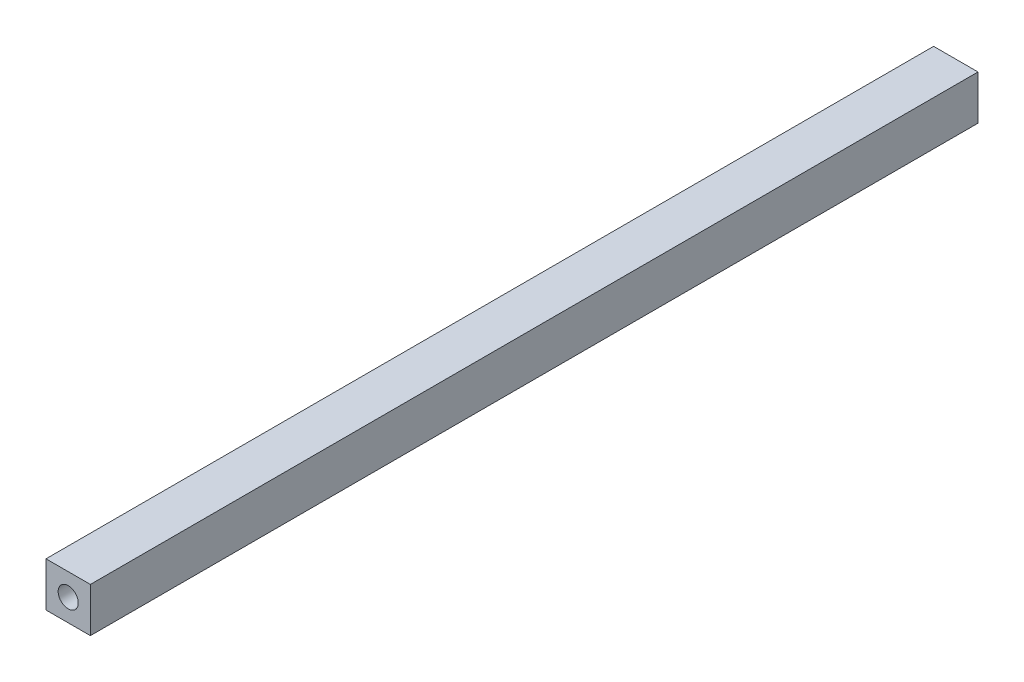
ISO-10303-21;
HEADER;
FILE_DESCRIPTION(('STEP AP214'),'2;1');
FILE_NAME('part.step','',(''),(''),'','','');
FILE_SCHEMA(('AUTOMOTIVE_DESIGN { 1 0 10303 214 1 1 1 1 }'));
ENDSEC;
DATA;
#1=APPLICATION_CONTEXT('core data for automotive mechanical design processes');
#2=APPLICATION_PROTOCOL_DEFINITION('international standard','automotive_design',2000,#1);
#3=PRODUCT_CONTEXT('',#1,'mechanical');
#4=PRODUCT('Part','Part','',(#3));
#5=PRODUCT_RELATED_PRODUCT_CATEGORY('part','',(#4));
#6=PRODUCT_DEFINITION_FORMATION('','',#4);
#7=PRODUCT_DEFINITION_CONTEXT('part definition',#1,'design');
#8=PRODUCT_DEFINITION('design','',#6,#7);
#9=PRODUCT_DEFINITION_SHAPE('','',#8);
#10=(LENGTH_UNIT() NAMED_UNIT(*) SI_UNIT(.MILLI.,.METRE.));
#11=(NAMED_UNIT(*) PLANE_ANGLE_UNIT() SI_UNIT($,.RADIAN.));
#12=(NAMED_UNIT(*) SI_UNIT($,.STERADIAN.) SOLID_ANGLE_UNIT());
#13=UNCERTAINTY_MEASURE_WITH_UNIT(LENGTH_MEASURE(1.E-05),#10,'distance_accuracy_value','');
#14=(GEOMETRIC_REPRESENTATION_CONTEXT(3) GLOBAL_UNCERTAINTY_ASSIGNED_CONTEXT((#13)) GLOBAL_UNIT_ASSIGNED_CONTEXT((#10,
#11,#12)) REPRESENTATION_CONTEXT('',''));
#15=CARTESIAN_POINT('',(0.,0.,0.));
#16=DIRECTION('',(0.,0.,1.));
#17=DIRECTION('',(1.,0.,0.));
#18=AXIS2_PLACEMENT_3D('',#15,#16,#17);
#19=CARTESIAN_POINT('',(7.5,7.5,150.));
#20=DIRECTION('',(-1.,0.,0.));
#21=DIRECTION('',(0.,-1.,0.));
#22=AXIS2_PLACEMENT_3D('',#19,#20,#21);
#23=PLANE('',#22);
#24=DIRECTION('',(0.,1.,0.));
#25=VECTOR('',#24,1.);
#26=CARTESIAN_POINT('',(7.5,7.5,-150.));
#27=LINE('',#26,#25);
#28=CARTESIAN_POINT('',(7.5,-7.5,-150.));
#29=VERTEX_POINT('',#28);
#30=CARTESIAN_POINT('',(7.5,7.5,-150.));
#31=VERTEX_POINT('',#30);
#32=EDGE_CURVE('E115',#29,#31,#27,.T.);
#33=ORIENTED_EDGE('',*,*,#32,.T.);
#34=DIRECTION('',(0.,0.,-1.));
#35=VECTOR('',#34,1.);
#36=CARTESIAN_POINT('',(7.5,7.5,150.));
#37=LINE('',#36,#35);
#38=CARTESIAN_POINT('',(7.5,7.5,150.));
#39=VERTEX_POINT('',#38);
#40=EDGE_CURVE('E11',#39,#31,#37,.T.);
#41=ORIENTED_EDGE('',*,*,#40,.F.);
#42=DIRECTION('',(0.,1.,0.));
#43=VECTOR('',#42,1.);
#44=CARTESIAN_POINT('',(7.5,7.5,150.));
#45=LINE('',#44,#43);
#46=CARTESIAN_POINT('',(7.5,-7.5,150.));
#47=VERTEX_POINT('',#46);
#48=EDGE_CURVE('E116',#47,#39,#45,.T.);
#49=ORIENTED_EDGE('',*,*,#48,.F.);
#50=DIRECTION('',(0.,0.,-1.));
#51=VECTOR('',#50,1.);
#52=CARTESIAN_POINT('',(7.5,-7.5,150.));
#53=LINE('',#52,#51);
#54=EDGE_CURVE('E122',#47,#29,#53,.T.);
#55=ORIENTED_EDGE('',*,*,#54,.T.);
#56=EDGE_LOOP('',(#33,#41,#49,#55));
#57=FACE_BOUND('',#56,.T.);
#58=ADVANCED_FACE('F40',(#57),#23,.F.);
#59=CARTESIAN_POINT('',(-7.5,7.5,150.));
#60=DIRECTION('',(0.,-1.,0.));
#61=DIRECTION('',(0.,0.,-1.));
#62=AXIS2_PLACEMENT_3D('',#59,#60,#61);
#63=PLANE('',#62);
#64=DIRECTION('',(-1.,0.,0.));
#65=VECTOR('',#64,1.);
#66=CARTESIAN_POINT('',(-7.5,7.5,-150.));
#67=LINE('',#66,#65);
#68=CARTESIAN_POINT('',(-7.5,7.5,-150.));
#69=VERTEX_POINT('',#68);
#70=EDGE_CURVE('E125',#31,#69,#67,.T.);
#71=ORIENTED_EDGE('',*,*,#70,.T.);
#72=DIRECTION('',(0.,0.,-1.));
#73=VECTOR('',#72,1.);
#74=CARTESIAN_POINT('',(-7.5,7.5,150.));
#75=LINE('',#74,#73);
#76=CARTESIAN_POINT('',(-7.5,7.5,150.));
#77=VERTEX_POINT('',#76);
#78=EDGE_CURVE('E48',#77,#69,#75,.T.);
#79=ORIENTED_EDGE('',*,*,#78,.F.);
#80=DIRECTION('',(-1.,0.,0.));
#81=VECTOR('',#80,1.);
#82=CARTESIAN_POINT('',(-7.5,7.5,150.));
#83=LINE('',#82,#81);
#84=EDGE_CURVE('E87',#39,#77,#83,.T.);
#85=ORIENTED_EDGE('',*,*,#84,.F.);
#86=ORIENTED_EDGE('',*,*,#40,.T.);
#87=EDGE_LOOP('',(#71,#79,#85,#86));
#88=FACE_BOUND('',#87,.T.);
#89=ADVANCED_FACE('F149',(#88),#63,.F.);
#90=CARTESIAN_POINT('',(-7.5,7.5,150.));
#91=DIRECTION('',(1.,0.,0.));
#92=DIRECTION('',(0.,1.,0.));
#93=AXIS2_PLACEMENT_3D('',#90,#91,#92);
#94=PLANE('',#93);
#95=DIRECTION('',(0.,-1.,0.));
#96=VECTOR('',#95,1.);
#97=CARTESIAN_POINT('',(-7.5,7.5,-150.));
#98=LINE('',#97,#96);
#99=CARTESIAN_POINT('',(-7.5,-7.5,-150.));
#100=VERTEX_POINT('',#99);
#101=EDGE_CURVE('E74',#69,#100,#98,.T.);
#102=ORIENTED_EDGE('',*,*,#101,.T.);
#103=DIRECTION('',(0.,0.,-1.));
#104=VECTOR('',#103,1.);
#105=CARTESIAN_POINT('',(-7.5,-7.5,150.));
#106=LINE('',#105,#104);
#107=CARTESIAN_POINT('',(-7.5,-7.5,150.));
#108=VERTEX_POINT('',#107);
#109=EDGE_CURVE('E130',#108,#100,#106,.T.);
#110=ORIENTED_EDGE('',*,*,#109,.F.);
#111=DIRECTION('',(0.,-1.,0.));
#112=VECTOR('',#111,1.);
#113=CARTESIAN_POINT('',(-7.5,7.5,150.));
#114=LINE('',#113,#112);
#115=EDGE_CURVE('E119',#77,#108,#114,.T.);
#116=ORIENTED_EDGE('',*,*,#115,.F.);
#117=ORIENTED_EDGE('',*,*,#78,.T.);
#118=EDGE_LOOP('',(#102,#110,#116,#117));
#119=FACE_BOUND('',#118,.T.);
#120=ADVANCED_FACE('F132',(#119),#94,.F.);
#121=CARTESIAN_POINT('',(-7.5,-7.5,150.));
#122=DIRECTION('',(0.,1.,0.));
#123=DIRECTION('',(0.,0.,1.));
#124=AXIS2_PLACEMENT_3D('',#121,#122,#123);
#125=PLANE('',#124);
#126=DIRECTION('',(1.,0.,0.));
#127=VECTOR('',#126,1.);
#128=CARTESIAN_POINT('',(-7.5,-7.5,-150.));
#129=LINE('',#128,#127);
#130=EDGE_CURVE('E80',#100,#29,#129,.T.);
#131=ORIENTED_EDGE('',*,*,#130,.T.);
#132=ORIENTED_EDGE('',*,*,#54,.F.);
#133=DIRECTION('',(1.,0.,0.));
#134=VECTOR('',#133,1.);
#135=CARTESIAN_POINT('',(-7.5,-7.5,150.));
#136=LINE('',#135,#134);
#137=EDGE_CURVE('E56',#108,#47,#136,.T.);
#138=ORIENTED_EDGE('',*,*,#137,.F.);
#139=ORIENTED_EDGE('',*,*,#109,.T.);
#140=EDGE_LOOP('',(#131,#132,#138,#139));
#141=FACE_BOUND('',#140,.T.);
#142=ADVANCED_FACE('F139',(#141),#125,.F.);
#143=CARTESIAN_POINT('',(0.,0.,150.));
#144=DIRECTION('',(0.,0.,1.));
#145=DIRECTION('',(1.,0.,0.));
#146=AXIS2_PLACEMENT_3D('',#143,#144,#145);
#147=PLANE('',#146);
#148=CARTESIAN_POINT('',(0.,0.,150.));
#149=DIRECTION('',(0.,0.,1.));
#150=DIRECTION('',(1.,0.,0.));
#151=AXIS2_PLACEMENT_3D('',#148,#149,#150);
#152=CIRCLE('',#151,3.39999999999999);
#153=CARTESIAN_POINT('',(3.39999999999999,0.,150.));
#154=VERTEX_POINT('',#153);
#155=EDGE_CURVE('E104',#154,#154,#152,.T.);
#156=ORIENTED_EDGE('',*,*,#155,.F.);
#157=EDGE_LOOP('',(#156));
#158=FACE_BOUND('',#157,.T.);
#159=ORIENTED_EDGE('',*,*,#48,.T.);
#160=ORIENTED_EDGE('',*,*,#84,.T.);
#161=ORIENTED_EDGE('',*,*,#115,.T.);
#162=ORIENTED_EDGE('',*,*,#137,.T.);
#163=EDGE_LOOP('',(#159,#160,#161,#162));
#164=FACE_BOUND('',#163,.T.);
#165=ADVANCED_FACE('F141',(#158,#164),#147,.T.);
#166=CARTESIAN_POINT('',(0.,0.,-150.));
#167=DIRECTION('',(0.,0.,1.));
#168=DIRECTION('',(1.,0.,0.));
#169=AXIS2_PLACEMENT_3D('',#166,#167,#168);
#170=PLANE('',#169);
#171=CARTESIAN_POINT('',(0.,0.,-150.));
#172=DIRECTION('',(0.,0.,-1.));
#173=DIRECTION('',(-1.,0.,0.));
#174=AXIS2_PLACEMENT_3D('',#171,#172,#173);
#175=CIRCLE('',#174,3.39999999999999);
#176=CARTESIAN_POINT('',(-3.39999999999999,0.,-150.));
#177=VERTEX_POINT('',#176);
#178=EDGE_CURVE('E105',#177,#177,#175,.T.);
#179=ORIENTED_EDGE('',*,*,#178,.F.);
#180=EDGE_LOOP('',(#179));
#181=FACE_BOUND('',#180,.T.);
#182=ORIENTED_EDGE('',*,*,#32,.F.);
#183=ORIENTED_EDGE('',*,*,#130,.F.);
#184=ORIENTED_EDGE('',*,*,#101,.F.);
#185=ORIENTED_EDGE('',*,*,#70,.F.);
#186=EDGE_LOOP('',(#182,#183,#184,#185));
#187=FACE_BOUND('',#186,.T.);
#188=ADVANCED_FACE('F135',(#181,#187),#170,.F.);
#189=CARTESIAN_POINT('',(0.,0.,127.75));
#190=DIRECTION('',(0.,0.,1.));
#191=DIRECTION('',(1.,0.,0.));
#192=AXIS2_PLACEMENT_3D('',#189,#190,#191);
#193=CONICAL_SURFACE('',#192,3.39999999999999,1.02974425867665);
#194=CARTESIAN_POINT('',(0.,0.,125.707073895306));
#195=VERTEX_POINT('',#194);
#196=VERTEX_LOOP('',#195);
#197=FACE_BOUND('',#196,.T.);
#198=CARTESIAN_POINT('',(0.,0.,127.75));
#199=DIRECTION('',(0.,0.,1.));
#200=DIRECTION('',(1.,0.,0.));
#201=AXIS2_PLACEMENT_3D('',#198,#199,#200);
#202=CIRCLE('',#201,3.39999999999999);
#203=CARTESIAN_POINT('',(3.39999999999999,0.,127.75));
#204=VERTEX_POINT('',#203);
#205=EDGE_CURVE('E108',#204,#204,#202,.T.);
#206=ORIENTED_EDGE('',*,*,#205,.T.);
#207=EDGE_LOOP('',(#206));
#208=FACE_BOUND('',#207,.T.);
#209=ADVANCED_FACE('F181',(#197,#208),#193,.F.);
#210=CARTESIAN_POINT('',(0.,0.,150.));
#211=DIRECTION('',(0.,0.,1.));
#212=DIRECTION('',(1.,0.,0.));
#213=AXIS2_PLACEMENT_3D('',#210,#211,#212);
#214=CYLINDRICAL_SURFACE('',#213,3.39999999999999);
#215=ORIENTED_EDGE('',*,*,#205,.F.);
#216=EDGE_LOOP('',(#215));
#217=FACE_BOUND('',#216,.T.);
#218=ORIENTED_EDGE('',*,*,#155,.T.);
#219=EDGE_LOOP('',(#218));
#220=FACE_BOUND('',#219,.T.);
#221=ADVANCED_FACE('F98',(#217,#220),#214,.F.);
#222=CARTESIAN_POINT('',(0.,0.,-127.75));
#223=DIRECTION('',(0.,0.,-1.));
#224=DIRECTION('',(-1.,0.,0.));
#225=AXIS2_PLACEMENT_3D('',#222,#223,#224);
#226=CONICAL_SURFACE('',#225,3.39999999999999,1.02974425867665);
#227=CARTESIAN_POINT('',(0.,0.,-125.707073895306));
#228=VERTEX_POINT('',#227);
#229=VERTEX_LOOP('',#228);
#230=FACE_BOUND('',#229,.T.);
#231=CARTESIAN_POINT('',(0.,0.,-127.75));
#232=DIRECTION('',(0.,0.,-1.));
#233=DIRECTION('',(-1.,0.,0.));
#234=AXIS2_PLACEMENT_3D('',#231,#232,#233);
#235=CIRCLE('',#234,3.39999999999999);
#236=CARTESIAN_POINT('',(-3.39999999999999,0.,-127.75));
#237=VERTEX_POINT('',#236);
#238=EDGE_CURVE('E102',#237,#237,#235,.T.);
#239=ORIENTED_EDGE('',*,*,#238,.T.);
#240=EDGE_LOOP('',(#239));
#241=FACE_BOUND('',#240,.T.);
#242=ADVANCED_FACE('F94',(#230,#241),#226,.F.);
#243=CARTESIAN_POINT('',(0.,0.,-150.));
#244=DIRECTION('',(0.,0.,-1.));
#245=DIRECTION('',(-1.,0.,0.));
#246=AXIS2_PLACEMENT_3D('',#243,#244,#245);
#247=CYLINDRICAL_SURFACE('',#246,3.39999999999999);
#248=ORIENTED_EDGE('',*,*,#238,.F.);
#249=EDGE_LOOP('',(#248));
#250=FACE_BOUND('',#249,.T.);
#251=ORIENTED_EDGE('',*,*,#178,.T.);
#252=EDGE_LOOP('',(#251));
#253=FACE_BOUND('',#252,.T.);
#254=ADVANCED_FACE('F97',(#250,#253),#247,.F.);
#255=CLOSED_SHELL('',(#58,#89,#120,#142,#165,#188,#209,#221,#242,#254));
#256=MANIFOLD_SOLID_BREP('B2',#255);
#257=ADVANCED_BREP_SHAPE_REPRESENTATION('',(#18,#256),#14);
#258=SHAPE_DEFINITION_REPRESENTATION(#9,#257);
ENDSEC;
END-ISO-10303-21;
